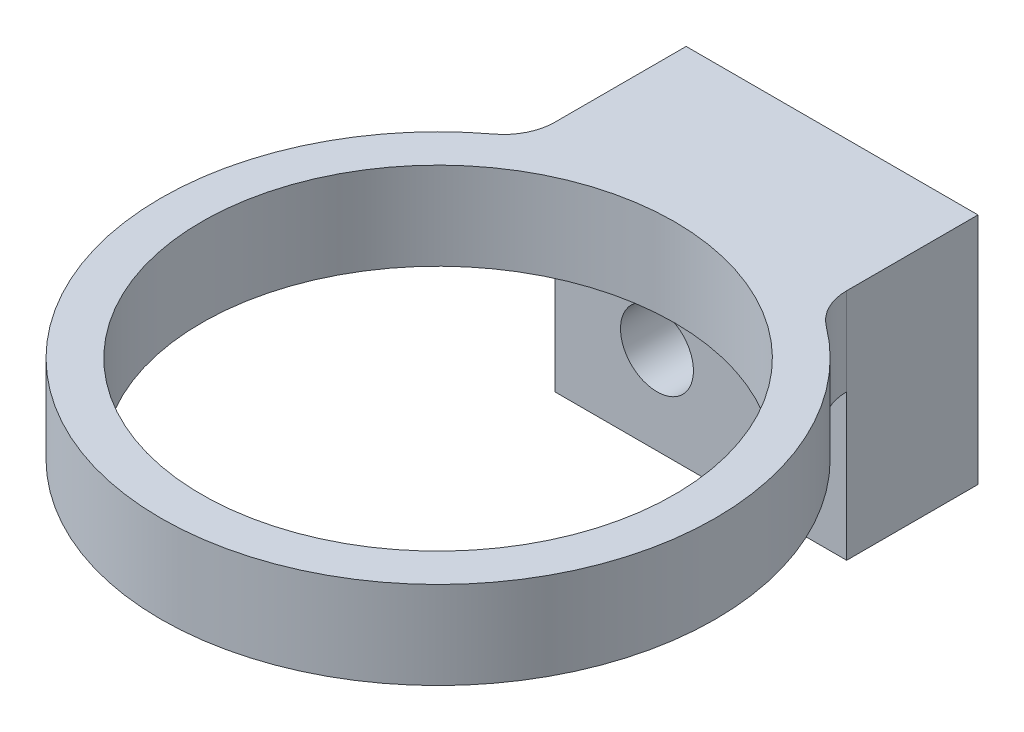
ISO-10303-21;
HEADER;
FILE_DESCRIPTION(('STEP AP214'),'2;1');
FILE_NAME('part.step','',(''),(''),'','','');
FILE_SCHEMA(('AUTOMOTIVE_DESIGN { 1 0 10303 214 1 1 1 1 }'));
ENDSEC;
DATA;
#1=APPLICATION_CONTEXT('core data for automotive mechanical design processes');
#2=APPLICATION_PROTOCOL_DEFINITION('international standard','automotive_design',2000,#1);
#3=PRODUCT_CONTEXT('',#1,'mechanical');
#4=PRODUCT('Part','Part','',(#3));
#5=PRODUCT_RELATED_PRODUCT_CATEGORY('part','',(#4));
#6=PRODUCT_DEFINITION_FORMATION('','',#4);
#7=PRODUCT_DEFINITION_CONTEXT('part definition',#1,'design');
#8=PRODUCT_DEFINITION('design','',#6,#7);
#9=PRODUCT_DEFINITION_SHAPE('','',#8);
#10=(LENGTH_UNIT() NAMED_UNIT(*) SI_UNIT(.MILLI.,.METRE.));
#11=(NAMED_UNIT(*) PLANE_ANGLE_UNIT() SI_UNIT($,.RADIAN.));
#12=(NAMED_UNIT(*) SI_UNIT($,.STERADIAN.) SOLID_ANGLE_UNIT());
#13=UNCERTAINTY_MEASURE_WITH_UNIT(LENGTH_MEASURE(1.E-05),#10,'distance_accuracy_value','');
#14=(GEOMETRIC_REPRESENTATION_CONTEXT(3) GLOBAL_UNCERTAINTY_ASSIGNED_CONTEXT((#13)) GLOBAL_UNIT_ASSIGNED_CONTEXT((#10,
#11,#12)) REPRESENTATION_CONTEXT('',''));
#15=CARTESIAN_POINT('',(0.,0.,0.));
#16=DIRECTION('',(0.,0.,1.));
#17=DIRECTION('',(1.,0.,0.));
#18=AXIS2_PLACEMENT_3D('',#15,#16,#17);
#19=CARTESIAN_POINT('',(0.,3.,13.5));
#20=DIRECTION('',(0.,-1.,0.));
#21=DIRECTION('',(0.,0.,-1.));
#22=AXIS2_PLACEMENT_3D('',#19,#20,#21);
#23=CYLINDRICAL_SURFACE('',#22,9.5);
#24=CARTESIAN_POINT('',(0.,3.,13.5));
#25=DIRECTION('',(0.,-1.,0.));
#26=DIRECTION('',(0.,0.,-1.));
#27=AXIS2_PLACEMENT_3D('',#24,#25,#26);
#28=CIRCLE('',#27,9.5);
#29=CARTESIAN_POINT('',(5.69999997703111,3.,5.89999998277333));
#30=VERTEX_POINT('',#29);
#31=CARTESIAN_POINT('',(-5.69999997703111,3.,5.89999998277333));
#32=VERTEX_POINT('',#31);
#33=EDGE_CURVE('E126',#30,#32,#28,.T.);
#34=ORIENTED_EDGE('',*,*,#33,.T.);
#35=DIRECTION('',(0.,-1.,0.));
#36=VECTOR('',#35,1.);
#37=CARTESIAN_POINT('',(-5.69999997703111,3.,5.89999998277333));
#38=LINE('',#37,#36);
#39=CARTESIAN_POINT('',(-5.69999997703111,0.,5.89999998277333));
#40=VERTEX_POINT('',#39);
#41=EDGE_CURVE('E143',#32,#40,#38,.T.);
#42=ORIENTED_EDGE('',*,*,#41,.T.);
#43=CARTESIAN_POINT('',(0.,0.,13.5));
#44=DIRECTION('',(0.,-1.,0.));
#45=DIRECTION('',(0.,0.,-1.));
#46=AXIS2_PLACEMENT_3D('',#43,#44,#45);
#47=CIRCLE('',#46,9.5);
#48=CARTESIAN_POINT('',(5.69999997703111,0.,5.89999998277333));
#49=VERTEX_POINT('',#48);
#50=EDGE_CURVE('E138',#49,#40,#47,.T.);
#51=ORIENTED_EDGE('',*,*,#50,.F.);
#52=DIRECTION('',(0.,-1.,0.));
#53=VECTOR('',#52,1.);
#54=CARTESIAN_POINT('',(5.69999997703111,3.,5.89999998277333));
#55=LINE('',#54,#53);
#56=EDGE_CURVE('E141',#49,#30,#55,.F.);
#57=ORIENTED_EDGE('',*,*,#56,.T.);
#58=EDGE_LOOP('',(#34,#42,#51,#57));
#59=FACE_BOUND('',#58,.T.);
#60=ADVANCED_FACE('F32',(#59),#23,.T.);
#61=CARTESIAN_POINT('',(5.,3.,0.));
#62=DIRECTION('',(1.,0.,0.));
#63=DIRECTION('',(0.,0.,-1.));
#64=AXIS2_PLACEMENT_3D('',#61,#62,#63);
#65=PLANE('',#64);
#66=DIRECTION('',(0.,0.,1.));
#67=VECTOR('',#66,1.);
#68=CARTESIAN_POINT('',(5.,3.,0.));
#69=LINE('',#68,#67);
#70=CARTESIAN_POINT('',(5.,3.,0.));
#71=VERTEX_POINT('',#70);
#72=CARTESIAN_POINT('',(5.,3.,4.500000034));
#73=VERTEX_POINT('',#72);
#74=EDGE_CURVE('E179',#71,#73,#69,.T.);
#75=ORIENTED_EDGE('',*,*,#74,.T.);
#76=DIRECTION('',(0.,1.,0.));
#77=VECTOR('',#76,1.);
#78=CARTESIAN_POINT('',(5.,0.,4.500000034));
#79=LINE('',#78,#77);
#80=CARTESIAN_POINT('',(5.,0.,4.5));
#81=VERTEX_POINT('',#80);
#82=EDGE_CURVE('E148',#73,#81,#79,.F.);
#83=ORIENTED_EDGE('',*,*,#82,.T.);
#84=DIRECTION('',(0.,1.,0.));
#85=VECTOR('',#84,1.);
#86=CARTESIAN_POINT('',(5.,-5.,4.5));
#87=LINE('',#86,#85);
#88=CARTESIAN_POINT('',(5.,-5.,4.5));
#89=VERTEX_POINT('',#88);
#90=EDGE_CURVE('E133',#89,#81,#87,.T.);
#91=ORIENTED_EDGE('',*,*,#90,.F.);
#92=DIRECTION('',(0.,0.,1.));
#93=VECTOR('',#92,1.);
#94=CARTESIAN_POINT('',(5.,-5.,4.5));
#95=LINE('',#94,#93);
#96=CARTESIAN_POINT('',(5.,-5.,0.));
#97=VERTEX_POINT('',#96);
#98=EDGE_CURVE('E116',#97,#89,#95,.T.);
#99=ORIENTED_EDGE('',*,*,#98,.F.);
#100=DIRECTION('',(0.,-1.,0.));
#101=VECTOR('',#100,1.);
#102=CARTESIAN_POINT('',(5.,3.,0.));
#103=LINE('',#102,#101);
#104=EDGE_CURVE('E144',#71,#97,#103,.T.);
#105=ORIENTED_EDGE('',*,*,#104,.F.);
#106=EDGE_LOOP('',(#75,#83,#91,#99,#105));
#107=FACE_BOUND('',#106,.T.);
#108=ADVANCED_FACE('F176',(#107),#65,.T.);
#109=CARTESIAN_POINT('',(-5.,3.,0.));
#110=DIRECTION('',(0.,0.,-1.));
#111=DIRECTION('',(-1.,0.,0.));
#112=AXIS2_PLACEMENT_3D('',#109,#110,#111);
#113=PLANE('',#112);
#114=CARTESIAN_POINT('',(-1.5,-2.,0.));
#115=DIRECTION('',(0.,0.,1.));
#116=DIRECTION('',(1.,0.,0.));
#117=AXIS2_PLACEMENT_3D('',#114,#115,#116);
#118=CIRCLE('',#117,1.24999999999999);
#119=CARTESIAN_POINT('',(-0.250000000000013,-2.,0.));
#120=VERTEX_POINT('',#119);
#121=EDGE_CURVE('E110',#120,#120,#118,.T.);
#122=ORIENTED_EDGE('',*,*,#121,.T.);
#123=EDGE_LOOP('',(#122));
#124=FACE_BOUND('',#123,.T.);
#125=CARTESIAN_POINT('',(3.,1.,0.));
#126=DIRECTION('',(0.,0.,-1.));
#127=DIRECTION('',(-1.,0.,0.));
#128=AXIS2_PLACEMENT_3D('',#125,#126,#127);
#129=CIRCLE('',#128,0.79999999999999);
#130=CARTESIAN_POINT('',(2.20000000000001,1.,0.));
#131=VERTEX_POINT('',#130);
#132=EDGE_CURVE('E104',#131,#131,#129,.T.);
#133=ORIENTED_EDGE('',*,*,#132,.F.);
#134=EDGE_LOOP('',(#133));
#135=FACE_BOUND('',#134,.T.);
#136=ORIENTED_EDGE('',*,*,#104,.T.);
#137=DIRECTION('',(1.,0.,0.));
#138=VECTOR('',#137,1.);
#139=CARTESIAN_POINT('',(5.,-5.,0.));
#140=LINE('',#139,#138);
#141=CARTESIAN_POINT('',(-5.,-5.,0.));
#142=VERTEX_POINT('',#141);
#143=EDGE_CURVE('E107',#142,#97,#140,.T.);
#144=ORIENTED_EDGE('',*,*,#143,.F.);
#145=DIRECTION('',(0.,-1.,0.));
#146=VECTOR('',#145,1.);
#147=CARTESIAN_POINT('',(-5.,3.,0.));
#148=LINE('',#147,#146);
#149=CARTESIAN_POINT('',(-5.,3.,0.));
#150=VERTEX_POINT('',#149);
#151=EDGE_CURVE('E130',#150,#142,#148,.T.);
#152=ORIENTED_EDGE('',*,*,#151,.F.);
#153=DIRECTION('',(1.,0.,0.));
#154=VECTOR('',#153,1.);
#155=CARTESIAN_POINT('',(-5.,3.,0.));
#156=LINE('',#155,#154);
#157=EDGE_CURVE('E182',#150,#71,#156,.T.);
#158=ORIENTED_EDGE('',*,*,#157,.T.);
#159=EDGE_LOOP('',(#136,#144,#152,#158));
#160=FACE_BOUND('',#159,.T.);
#161=ADVANCED_FACE('F188',(#124,#135,#160),#113,.T.);
#162=CARTESIAN_POINT('',(-5.,3.,5.42225278929824));
#163=DIRECTION('',(-1.,0.,0.));
#164=DIRECTION('',(0.,0.,1.));
#165=AXIS2_PLACEMENT_3D('',#162,#163,#164);
#166=PLANE('',#165);
#167=DIRECTION('',(0.,1.,0.));
#168=VECTOR('',#167,1.);
#169=CARTESIAN_POINT('',(-5.,-5.,4.5));
#170=LINE('',#169,#168);
#171=CARTESIAN_POINT('',(-5.,-5.,4.5));
#172=VERTEX_POINT('',#171);
#173=CARTESIAN_POINT('',(-5.,0.,4.5));
#174=VERTEX_POINT('',#173);
#175=EDGE_CURVE('E123',#172,#174,#170,.T.);
#176=ORIENTED_EDGE('',*,*,#175,.T.);
#177=DIRECTION('',(0.,1.,0.));
#178=VECTOR('',#177,1.);
#179=CARTESIAN_POINT('',(-5.,3.,4.500000034));
#180=LINE('',#179,#178);
#181=CARTESIAN_POINT('',(-5.,3.,4.500000034));
#182=VERTEX_POINT('',#181);
#183=EDGE_CURVE('E53',#174,#182,#180,.T.);
#184=ORIENTED_EDGE('',*,*,#183,.T.);
#185=DIRECTION('',(0.,0.,-1.));
#186=VECTOR('',#185,1.);
#187=CARTESIAN_POINT('',(-5.,3.,5.42225278929824));
#188=LINE('',#187,#186);
#189=EDGE_CURVE('E184',#182,#150,#188,.T.);
#190=ORIENTED_EDGE('',*,*,#189,.T.);
#191=ORIENTED_EDGE('',*,*,#151,.T.);
#192=DIRECTION('',(0.,0.,-1.));
#193=VECTOR('',#192,1.);
#194=CARTESIAN_POINT('',(-5.,-5.,0.));
#195=LINE('',#194,#193);
#196=EDGE_CURVE('E120',#172,#142,#195,.T.);
#197=ORIENTED_EDGE('',*,*,#196,.F.);
#198=EDGE_LOOP('',(#176,#184,#190,#191,#197));
#199=FACE_BOUND('',#198,.T.);
#200=ADVANCED_FACE('F193',(#199),#166,.T.);
#201=CARTESIAN_POINT('',(0.,3.,13.5));
#202=DIRECTION('',(0.,-1.,0.));
#203=DIRECTION('',(0.,0.,-1.));
#204=AXIS2_PLACEMENT_3D('',#201,#202,#203);
#205=PLANE('',#204);
#206=CARTESIAN_POINT('',(0.,3.,13.5));
#207=DIRECTION('',(0.,-1.,0.));
#208=DIRECTION('',(0.,0.,-1.));
#209=AXIS2_PLACEMENT_3D('',#206,#207,#208);
#210=CIRCLE('',#209,8.09999999999999);
#211=CARTESIAN_POINT('',(0.,3.,5.40000000000001));
#212=VERTEX_POINT('',#211);
#213=EDGE_CURVE('E254',#212,#212,#210,.T.);
#214=ORIENTED_EDGE('',*,*,#213,.T.);
#215=EDGE_LOOP('',(#214));
#216=FACE_BOUND('',#215,.T.);
#217=ORIENTED_EDGE('',*,*,#33,.F.);
#218=CARTESIAN_POINT('',(6.749999932,3.,4.500000034));
#219=DIRECTION('',(0.,-1.,0.));
#220=DIRECTION('',(0.,0.,-1.));
#221=AXIS2_PLACEMENT_3D('',#218,#219,#220);
#222=CIRCLE('',#221,1.749999932);
#223=EDGE_CURVE('E11',#30,#73,#222,.T.);
#224=ORIENTED_EDGE('',*,*,#223,.T.);
#225=ORIENTED_EDGE('',*,*,#74,.F.);
#226=ORIENTED_EDGE('',*,*,#157,.F.);
#227=ORIENTED_EDGE('',*,*,#189,.F.);
#228=CARTESIAN_POINT('',(-6.749999932,3.,4.500000034));
#229=DIRECTION('',(0.,-1.,0.));
#230=DIRECTION('',(0.,0.,-1.));
#231=AXIS2_PLACEMENT_3D('',#228,#229,#230);
#232=CIRCLE('',#231,1.749999932);
#233=EDGE_CURVE('E157',#182,#32,#232,.T.);
#234=ORIENTED_EDGE('',*,*,#233,.T.);
#235=EDGE_LOOP('',(#217,#224,#225,#226,#227,#234));
#236=FACE_BOUND('',#235,.T.);
#237=ADVANCED_FACE('F194',(#216,#236),#205,.F.);
#238=CARTESIAN_POINT('',(0.,0.,13.5));
#239=DIRECTION('',(0.,-1.,0.));
#240=DIRECTION('',(0.,0.,-1.));
#241=AXIS2_PLACEMENT_3D('',#238,#239,#240);
#242=PLANE('',#241);
#243=CARTESIAN_POINT('',(0.,0.,13.5));
#244=DIRECTION('',(0.,-1.,0.));
#245=DIRECTION('',(0.,0.,-1.));
#246=AXIS2_PLACEMENT_3D('',#243,#244,#245);
#247=CIRCLE('',#246,8.09999999999999);
#248=CARTESIAN_POINT('',(0.,0.,5.40000000000001));
#249=VERTEX_POINT('',#248);
#250=EDGE_CURVE('E256',#249,#249,#247,.T.);
#251=ORIENTED_EDGE('',*,*,#250,.F.);
#252=EDGE_LOOP('',(#251));
#253=FACE_BOUND('',#252,.T.);
#254=DIRECTION('',(-1.,0.,0.));
#255=VECTOR('',#254,1.);
#256=CARTESIAN_POINT('',(-5.,0.,4.5));
#257=LINE('',#256,#255);
#258=EDGE_CURVE('E103',#81,#174,#257,.T.);
#259=ORIENTED_EDGE('',*,*,#258,.F.);
#260=CARTESIAN_POINT('',(6.749999932,0.,4.500000034));
#261=DIRECTION('',(0.,-1.,0.));
#262=DIRECTION('',(0.,0.,-1.));
#263=AXIS2_PLACEMENT_3D('',#260,#261,#262);
#264=CIRCLE('',#263,1.749999932);
#265=EDGE_CURVE('E40',#81,#49,#264,.F.);
#266=ORIENTED_EDGE('',*,*,#265,.T.);
#267=ORIENTED_EDGE('',*,*,#50,.T.);
#268=CARTESIAN_POINT('',(-6.749999932,0.,4.500000034));
#269=DIRECTION('',(0.,-1.,0.));
#270=DIRECTION('',(0.,0.,-1.));
#271=AXIS2_PLACEMENT_3D('',#268,#269,#270);
#272=CIRCLE('',#271,1.749999932);
#273=EDGE_CURVE('E153',#40,#174,#272,.F.);
#274=ORIENTED_EDGE('',*,*,#273,.T.);
#275=EDGE_LOOP('',(#259,#266,#267,#274));
#276=FACE_BOUND('',#275,.T.);
#277=ADVANCED_FACE('F166',(#253,#276),#242,.T.);
#278=CARTESIAN_POINT('',(-5.,-5.,4.5));
#279=DIRECTION('',(0.,0.,-1.));
#280=DIRECTION('',(-1.,0.,0.));
#281=AXIS2_PLACEMENT_3D('',#278,#279,#280);
#282=PLANE('',#281);
#283=CARTESIAN_POINT('',(-1.5,-2.,4.5));
#284=DIRECTION('',(0.,0.,1.));
#285=DIRECTION('',(1.,0.,0.));
#286=AXIS2_PLACEMENT_3D('',#283,#284,#285);
#287=CIRCLE('',#286,1.24999999999999);
#288=CARTESIAN_POINT('',(-0.250000000000013,-2.,4.5));
#289=VERTEX_POINT('',#288);
#290=EDGE_CURVE('E255',#289,#289,#287,.T.);
#291=ORIENTED_EDGE('',*,*,#290,.F.);
#292=EDGE_LOOP('',(#291));
#293=FACE_BOUND('',#292,.T.);
#294=ORIENTED_EDGE('',*,*,#258,.T.);
#295=ORIENTED_EDGE('',*,*,#175,.F.);
#296=DIRECTION('',(-1.,0.,0.));
#297=VECTOR('',#296,1.);
#298=CARTESIAN_POINT('',(-5.,-5.,4.5));
#299=LINE('',#298,#297);
#300=EDGE_CURVE('E118',#89,#172,#299,.T.);
#301=ORIENTED_EDGE('',*,*,#300,.F.);
#302=ORIENTED_EDGE('',*,*,#90,.T.);
#303=EDGE_LOOP('',(#294,#295,#301,#302));
#304=FACE_BOUND('',#303,.T.);
#305=ADVANCED_FACE('F199',(#293,#304),#282,.F.);
#306=CARTESIAN_POINT('',(0.,-5.,0.));
#307=DIRECTION('',(0.,1.,0.));
#308=DIRECTION('',(0.,0.,1.));
#309=AXIS2_PLACEMENT_3D('',#306,#307,#308);
#310=PLANE('',#309);
#311=ORIENTED_EDGE('',*,*,#143,.T.);
#312=ORIENTED_EDGE('',*,*,#98,.T.);
#313=ORIENTED_EDGE('',*,*,#300,.T.);
#314=ORIENTED_EDGE('',*,*,#196,.T.);
#315=EDGE_LOOP('',(#311,#312,#313,#314));
#316=FACE_BOUND('',#315,.T.);
#317=ADVANCED_FACE('F97',(#316),#310,.F.);
#318=CARTESIAN_POINT('',(3.,1.,4.));
#319=DIRECTION('',(0.,0.,-1.));
#320=DIRECTION('',(-1.,0.,0.));
#321=AXIS2_PLACEMENT_3D('',#318,#319,#320);
#322=CONICAL_SURFACE('',#321,0.799999999999988,1.02974425888058);
#323=CARTESIAN_POINT('',(3.,1.,4.480688495));
#324=VERTEX_POINT('',#323);
#325=VERTEX_LOOP('',#324);
#326=FACE_BOUND('',#325,.T.);
#327=CARTESIAN_POINT('',(3.,1.,4.));
#328=DIRECTION('',(0.,0.,-1.));
#329=DIRECTION('',(-1.,0.,0.));
#330=AXIS2_PLACEMENT_3D('',#327,#328,#329);
#331=CIRCLE('',#330,0.799999999999988);
#332=CARTESIAN_POINT('',(2.20000000000001,1.,4.));
#333=VERTEX_POINT('',#332);
#334=EDGE_CURVE('E101',#333,#333,#331,.T.);
#335=ORIENTED_EDGE('',*,*,#334,.T.);
#336=EDGE_LOOP('',(#335));
#337=FACE_BOUND('',#336,.T.);
#338=ADVANCED_FACE('F93',(#326,#337),#322,.F.);
#339=CARTESIAN_POINT('',(3.,1.,0.));
#340=DIRECTION('',(0.,0.,-1.));
#341=DIRECTION('',(-1.,0.,0.));
#342=AXIS2_PLACEMENT_3D('',#339,#340,#341);
#343=CYLINDRICAL_SURFACE('',#342,0.799999999999989);
#344=ORIENTED_EDGE('',*,*,#334,.F.);
#345=EDGE_LOOP('',(#344));
#346=FACE_BOUND('',#345,.T.);
#347=ORIENTED_EDGE('',*,*,#132,.T.);
#348=EDGE_LOOP('',(#347));
#349=FACE_BOUND('',#348,.T.);
#350=ADVANCED_FACE('F96',(#346,#349),#343,.F.);
#351=CARTESIAN_POINT('',(-1.5,-2.,4.5));
#352=DIRECTION('',(0.,0.,1.));
#353=DIRECTION('',(1.,0.,0.));
#354=AXIS2_PLACEMENT_3D('',#351,#352,#353);
#355=CYLINDRICAL_SURFACE('',#354,1.24999999999999);
#356=ORIENTED_EDGE('',*,*,#121,.F.);
#357=EDGE_LOOP('',(#356));
#358=FACE_BOUND('',#357,.T.);
#359=ORIENTED_EDGE('',*,*,#290,.T.);
#360=EDGE_LOOP('',(#359));
#361=FACE_BOUND('',#360,.T.);
#362=ADVANCED_FACE('F226',(#358,#361),#355,.F.);
#363=CARTESIAN_POINT('',(0.,0.,13.5));
#364=DIRECTION('',(0.,-1.,0.));
#365=DIRECTION('',(0.,0.,-1.));
#366=AXIS2_PLACEMENT_3D('',#363,#364,#365);
#367=CYLINDRICAL_SURFACE('',#366,8.09999999999999);
#368=ORIENTED_EDGE('',*,*,#213,.F.);
#369=EDGE_LOOP('',(#368));
#370=FACE_BOUND('',#369,.T.);
#371=ORIENTED_EDGE('',*,*,#250,.T.);
#372=EDGE_LOOP('',(#371));
#373=FACE_BOUND('',#372,.T.);
#374=ADVANCED_FACE('F221',(#370,#373),#367,.F.);
#375=CARTESIAN_POINT('',(-6.749999932,3.,4.500000034));
#376=DIRECTION('',(0.,-1.,0.));
#377=DIRECTION('',(0.,0.,-1.));
#378=AXIS2_PLACEMENT_3D('',#375,#376,#377);
#379=CYLINDRICAL_SURFACE('',#378,1.749999932);
#380=ORIENTED_EDGE('',*,*,#233,.F.);
#381=ORIENTED_EDGE('',*,*,#183,.F.);
#382=ORIENTED_EDGE('',*,*,#273,.F.);
#383=ORIENTED_EDGE('',*,*,#41,.F.);
#384=EDGE_LOOP('',(#380,#381,#382,#383));
#385=FACE_BOUND('',#384,.T.);
#386=ADVANCED_FACE('F197',(#385),#379,.F.);
#387=CARTESIAN_POINT('',(6.749999932,3.,4.500000034));
#388=DIRECTION('',(0.,-1.,0.));
#389=DIRECTION('',(0.,0.,-1.));
#390=AXIS2_PLACEMENT_3D('',#387,#388,#389);
#391=CYLINDRICAL_SURFACE('',#390,1.749999932);
#392=ORIENTED_EDGE('',*,*,#223,.F.);
#393=ORIENTED_EDGE('',*,*,#56,.F.);
#394=ORIENTED_EDGE('',*,*,#265,.F.);
#395=ORIENTED_EDGE('',*,*,#82,.F.);
#396=EDGE_LOOP('',(#392,#393,#394,#395));
#397=FACE_BOUND('',#396,.T.);
#398=ADVANCED_FACE('F34',(#397),#391,.F.);
#399=CLOSED_SHELL('',(#60,#108,#161,#200,#237,#277,#305,#317,#338,#350,#362,#374,#386,#398));
#400=MANIFOLD_SOLID_BREP('B2',#399);
#401=ADVANCED_BREP_SHAPE_REPRESENTATION('',(#18,#400),#14);
#402=SHAPE_DEFINITION_REPRESENTATION(#9,#401);
ENDSEC;
END-ISO-10303-21;
